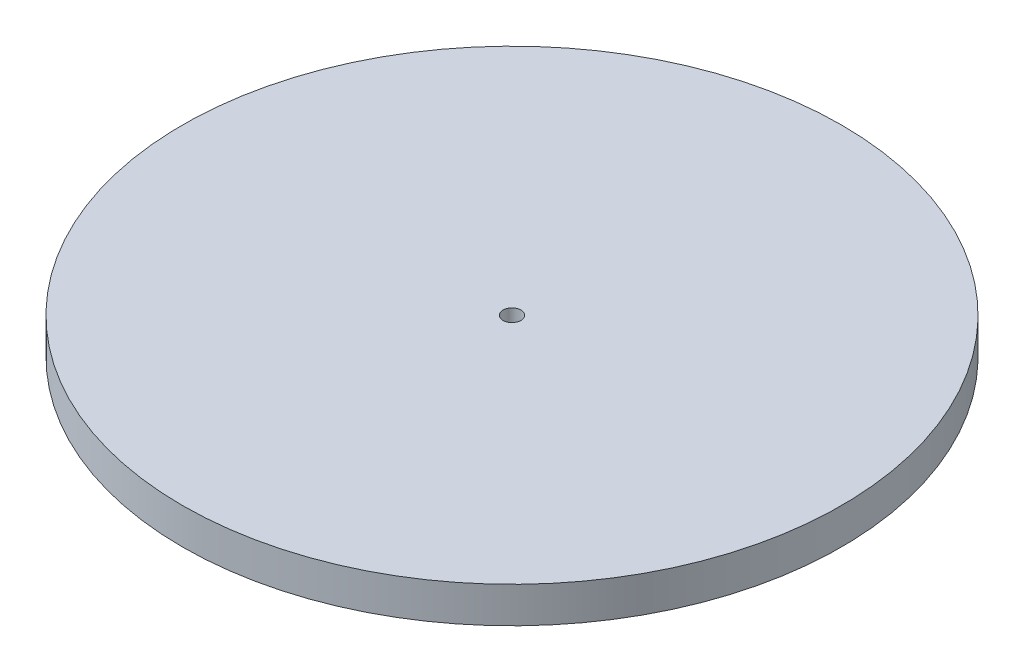
ISO-10303-21;
HEADER;
FILE_DESCRIPTION(('STEP AP214'),'2;1');
FILE_NAME('part.step','',(''),(''),'','','');
FILE_SCHEMA(('AUTOMOTIVE_DESIGN { 1 0 10303 214 1 1 1 1 }'));
ENDSEC;
DATA;
#1=APPLICATION_CONTEXT('core data for automotive mechanical design processes');
#2=APPLICATION_PROTOCOL_DEFINITION('international standard','automotive_design',2000,#1);
#3=PRODUCT_CONTEXT('',#1,'mechanical');
#4=PRODUCT('Part','Part','',(#3));
#5=PRODUCT_RELATED_PRODUCT_CATEGORY('part','',(#4));
#6=PRODUCT_DEFINITION_FORMATION('','',#4);
#7=PRODUCT_DEFINITION_CONTEXT('part definition',#1,'design');
#8=PRODUCT_DEFINITION('design','',#6,#7);
#9=PRODUCT_DEFINITION_SHAPE('','',#8);
#10=(LENGTH_UNIT() NAMED_UNIT(*) SI_UNIT(.MILLI.,.METRE.));
#11=(NAMED_UNIT(*) PLANE_ANGLE_UNIT() SI_UNIT($,.RADIAN.));
#12=(NAMED_UNIT(*) SI_UNIT($,.STERADIAN.) SOLID_ANGLE_UNIT());
#13=UNCERTAINTY_MEASURE_WITH_UNIT(LENGTH_MEASURE(1.E-05),#10,'distance_accuracy_value','');
#14=(GEOMETRIC_REPRESENTATION_CONTEXT(3) GLOBAL_UNCERTAINTY_ASSIGNED_CONTEXT((#13)) GLOBAL_UNIT_ASSIGNED_CONTEXT((#10,
#11,#12)) REPRESENTATION_CONTEXT('',''));
#15=CARTESIAN_POINT('',(0.,0.,0.));
#16=DIRECTION('',(0.,0.,1.));
#17=DIRECTION('',(1.,0.,0.));
#18=AXIS2_PLACEMENT_3D('',#15,#16,#17);
#19=CARTESIAN_POINT('',(0.,3.,0.));
#20=DIRECTION('',(0.,1.,0.));
#21=DIRECTION('',(0.,0.,1.));
#22=AXIS2_PLACEMENT_3D('',#19,#20,#21);
#23=PLANE('',#22);
#24=CARTESIAN_POINT('',(0.,3.,0.));
#25=DIRECTION('',(0.,1.,0.));
#26=DIRECTION('',(0.,0.,1.));
#27=AXIS2_PLACEMENT_3D('',#24,#25,#26);
#28=CIRCLE('',#27,27.5);
#29=CARTESIAN_POINT('',(0.,3.,27.5));
#30=VERTEX_POINT('',#29);
#31=EDGE_CURVE('E10',#30,#30,#28,.T.);
#32=ORIENTED_EDGE('',*,*,#31,.T.);
#33=EDGE_LOOP('',(#32));
#34=FACE_BOUND('',#33,.T.);
#35=CARTESIAN_POINT('',(0.,3.,0.));
#36=DIRECTION('',(0.,1.,0.));
#37=DIRECTION('',(0.,0.,1.));
#38=AXIS2_PLACEMENT_3D('',#35,#36,#37);
#39=CIRCLE('',#38,0.75);
#40=CARTESIAN_POINT('',(0.,3.,0.75));
#41=VERTEX_POINT('',#40);
#42=EDGE_CURVE('E44',#41,#41,#39,.T.);
#43=ORIENTED_EDGE('',*,*,#42,.F.);
#44=EDGE_LOOP('',(#43));
#45=FACE_BOUND('',#44,.T.);
#46=ADVANCED_FACE('F33',(#34,#45),#23,.T.);
#47=CARTESIAN_POINT('',(0.,0.,0.));
#48=DIRECTION('',(0.,1.,0.));
#49=DIRECTION('',(0.,0.,1.));
#50=AXIS2_PLACEMENT_3D('',#47,#48,#49);
#51=PLANE('',#50);
#52=CARTESIAN_POINT('',(0.,0.,0.));
#53=DIRECTION('',(0.,1.,0.));
#54=DIRECTION('',(0.,0.,1.));
#55=AXIS2_PLACEMENT_3D('',#52,#53,#54);
#56=CIRCLE('',#55,27.5);
#57=CARTESIAN_POINT('',(0.,0.,27.5));
#58=VERTEX_POINT('',#57);
#59=EDGE_CURVE('E37',#58,#58,#56,.T.);
#60=ORIENTED_EDGE('',*,*,#59,.F.);
#61=EDGE_LOOP('',(#60));
#62=FACE_BOUND('',#61,.T.);
#63=CARTESIAN_POINT('',(0.,0.,0.));
#64=DIRECTION('',(0.,1.,0.));
#65=DIRECTION('',(0.,0.,1.));
#66=AXIS2_PLACEMENT_3D('',#63,#64,#65);
#67=CIRCLE('',#66,0.75);
#68=CARTESIAN_POINT('',(0.,0.,0.75));
#69=VERTEX_POINT('',#68);
#70=EDGE_CURVE('E46',#69,#69,#67,.T.);
#71=ORIENTED_EDGE('',*,*,#70,.T.);
#72=EDGE_LOOP('',(#71));
#73=FACE_BOUND('',#72,.T.);
#74=ADVANCED_FACE('F56',(#62,#73),#51,.F.);
#75=CARTESIAN_POINT('',(0.,3.,0.));
#76=DIRECTION('',(0.,-1.,0.));
#77=DIRECTION('',(0.,0.,-1.));
#78=AXIS2_PLACEMENT_3D('',#75,#76,#77);
#79=CYLINDRICAL_SURFACE('',#78,27.5);
#80=ORIENTED_EDGE('',*,*,#31,.F.);
#81=EDGE_LOOP('',(#80));
#82=FACE_BOUND('',#81,.T.);
#83=ORIENTED_EDGE('',*,*,#59,.T.);
#84=EDGE_LOOP('',(#83));
#85=FACE_BOUND('',#84,.T.);
#86=ADVANCED_FACE('F35',(#82,#85),#79,.T.);
#87=CARTESIAN_POINT('',(0.,3.,0.));
#88=DIRECTION('',(0.,-1.,0.));
#89=DIRECTION('',(0.,0.,-1.));
#90=AXIS2_PLACEMENT_3D('',#87,#88,#89);
#91=CYLINDRICAL_SURFACE('',#90,0.75);
#92=ORIENTED_EDGE('',*,*,#42,.T.);
#93=EDGE_LOOP('',(#92));
#94=FACE_BOUND('',#93,.T.);
#95=ORIENTED_EDGE('',*,*,#70,.F.);
#96=EDGE_LOOP('',(#95));
#97=FACE_BOUND('',#96,.T.);
#98=ADVANCED_FACE('F52',(#94,#97),#91,.F.);
#99=CLOSED_SHELL('',(#46,#74,#86,#98));
#100=MANIFOLD_SOLID_BREP('B2',#99);
#101=ADVANCED_BREP_SHAPE_REPRESENTATION('',(#18,#100),#14);
#102=SHAPE_DEFINITION_REPRESENTATION(#9,#101);
ENDSEC;
END-ISO-10303-21;
